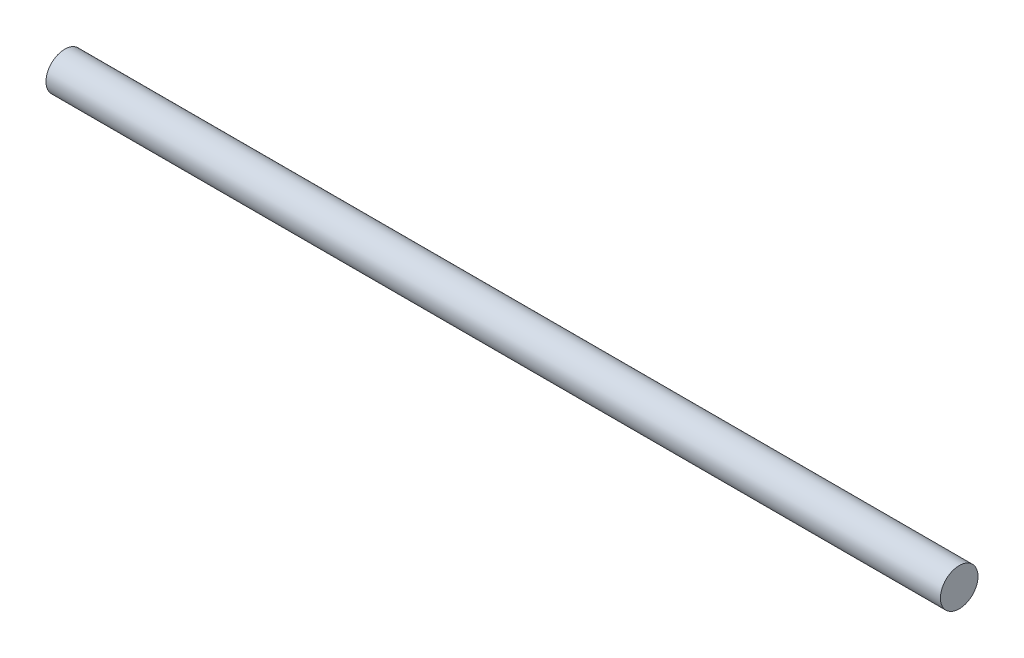
ISO-10303-21;
HEADER;
FILE_DESCRIPTION(('STEP AP214'),'2;1');
FILE_NAME('part.step','',(''),(''),'','','');
FILE_SCHEMA(('AUTOMOTIVE_DESIGN { 1 0 10303 214 1 1 1 1 }'));
ENDSEC;
DATA;
#1=APPLICATION_CONTEXT('core data for automotive mechanical design processes');
#2=APPLICATION_PROTOCOL_DEFINITION('international standard','automotive_design',2000,#1);
#3=PRODUCT_CONTEXT('',#1,'mechanical');
#4=PRODUCT('Part','Part','',(#3));
#5=PRODUCT_RELATED_PRODUCT_CATEGORY('part','',(#4));
#6=PRODUCT_DEFINITION_FORMATION('','',#4);
#7=PRODUCT_DEFINITION_CONTEXT('part definition',#1,'design');
#8=PRODUCT_DEFINITION('design','',#6,#7);
#9=PRODUCT_DEFINITION_SHAPE('','',#8);
#10=(LENGTH_UNIT() NAMED_UNIT(*) SI_UNIT(.MILLI.,.METRE.));
#11=(NAMED_UNIT(*) PLANE_ANGLE_UNIT() SI_UNIT($,.RADIAN.));
#12=(NAMED_UNIT(*) SI_UNIT($,.STERADIAN.) SOLID_ANGLE_UNIT());
#13=UNCERTAINTY_MEASURE_WITH_UNIT(LENGTH_MEASURE(1.E-05),#10,'distance_accuracy_value','');
#14=(GEOMETRIC_REPRESENTATION_CONTEXT(3) GLOBAL_UNCERTAINTY_ASSIGNED_CONTEXT((#13)) GLOBAL_UNIT_ASSIGNED_CONTEXT((#10,
#11,#12)) REPRESENTATION_CONTEXT('',''));
#15=CARTESIAN_POINT('',(0.,0.,0.));
#16=DIRECTION('',(0.,0.,1.));
#17=DIRECTION('',(1.,0.,0.));
#18=AXIS2_PLACEMENT_3D('',#15,#16,#17);
#19=CARTESIAN_POINT('',(148.75,0.,0.));
#20=DIRECTION('',(-1.,0.,0.));
#21=DIRECTION('',(0.,0.,1.));
#22=AXIS2_PLACEMENT_3D('',#19,#20,#21);
#23=CYLINDRICAL_SURFACE('',#22,6.25);
#24=CARTESIAN_POINT('',(148.75,0.,0.));
#25=DIRECTION('',(1.,0.,0.));
#26=DIRECTION('',(0.,0.,-1.));
#27=AXIS2_PLACEMENT_3D('',#24,#25,#26);
#28=CIRCLE('',#27,6.25);
#29=CARTESIAN_POINT('',(148.75,0.,-6.25));
#30=VERTEX_POINT('',#29);
#31=EDGE_CURVE('E10',#30,#30,#28,.T.);
#32=ORIENTED_EDGE('',*,*,#31,.F.);
#33=EDGE_LOOP('',(#32));
#34=FACE_BOUND('',#33,.T.);
#35=CARTESIAN_POINT('',(-148.75,0.,0.));
#36=DIRECTION('',(1.,0.,0.));
#37=DIRECTION('',(0.,0.,-1.));
#38=AXIS2_PLACEMENT_3D('',#35,#36,#37);
#39=CIRCLE('',#38,6.25);
#40=CARTESIAN_POINT('',(-148.75,0.,-6.25));
#41=VERTEX_POINT('',#40);
#42=EDGE_CURVE('E34',#41,#41,#39,.T.);
#43=ORIENTED_EDGE('',*,*,#42,.T.);
#44=EDGE_LOOP('',(#43));
#45=FACE_BOUND('',#44,.T.);
#46=ADVANCED_FACE('F31',(#34,#45),#23,.T.);
#47=CARTESIAN_POINT('',(148.75,0.,0.));
#48=DIRECTION('',(1.,0.,0.));
#49=DIRECTION('',(0.,0.,-1.));
#50=AXIS2_PLACEMENT_3D('',#47,#48,#49);
#51=PLANE('',#50);
#52=ORIENTED_EDGE('',*,*,#31,.T.);
#53=EDGE_LOOP('',(#52));
#54=FACE_BOUND('',#53,.T.);
#55=ADVANCED_FACE('F46',(#54),#51,.T.);
#56=CARTESIAN_POINT('',(-148.75,0.,0.));
#57=DIRECTION('',(1.,0.,0.));
#58=DIRECTION('',(0.,0.,-1.));
#59=AXIS2_PLACEMENT_3D('',#56,#57,#58);
#60=PLANE('',#59);
#61=ORIENTED_EDGE('',*,*,#42,.F.);
#62=EDGE_LOOP('',(#61));
#63=FACE_BOUND('',#62,.T.);
#64=ADVANCED_FACE('F44',(#63),#60,.F.);
#65=CLOSED_SHELL('',(#46,#55,#64));
#66=MANIFOLD_SOLID_BREP('B2',#65);
#67=ADVANCED_BREP_SHAPE_REPRESENTATION('',(#18,#66),#14);
#68=SHAPE_DEFINITION_REPRESENTATION(#9,#67);
ENDSEC;
END-ISO-10303-21;
